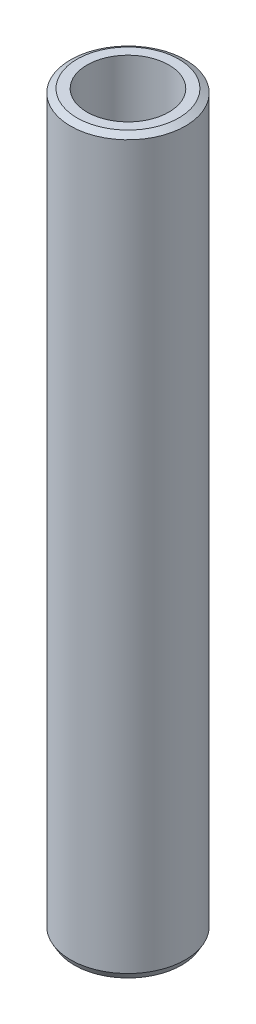
ISO-10303-21;
HEADER;
FILE_DESCRIPTION(('STEP AP214'),'2;1');
FILE_NAME('part.step','',(''),(''),'','','');
FILE_SCHEMA(('AUTOMOTIVE_DESIGN { 1 0 10303 214 1 1 1 1 }'));
ENDSEC;
DATA;
#1=APPLICATION_CONTEXT('core data for automotive mechanical design processes');
#2=APPLICATION_PROTOCOL_DEFINITION('international standard','automotive_design',2000,#1);
#3=PRODUCT_CONTEXT('',#1,'mechanical');
#4=PRODUCT('Part','Part','',(#3));
#5=PRODUCT_RELATED_PRODUCT_CATEGORY('part','',(#4));
#6=PRODUCT_DEFINITION_FORMATION('','',#4);
#7=PRODUCT_DEFINITION_CONTEXT('part definition',#1,'design');
#8=PRODUCT_DEFINITION('design','',#6,#7);
#9=PRODUCT_DEFINITION_SHAPE('','',#8);
#10=(LENGTH_UNIT() NAMED_UNIT(*) SI_UNIT(.MILLI.,.METRE.));
#11=(NAMED_UNIT(*) PLANE_ANGLE_UNIT() SI_UNIT($,.RADIAN.));
#12=(NAMED_UNIT(*) SI_UNIT($,.STERADIAN.) SOLID_ANGLE_UNIT());
#13=UNCERTAINTY_MEASURE_WITH_UNIT(LENGTH_MEASURE(1.E-05),#10,'distance_accuracy_value','');
#14=(GEOMETRIC_REPRESENTATION_CONTEXT(3) GLOBAL_UNCERTAINTY_ASSIGNED_CONTEXT((#13)) GLOBAL_UNIT_ASSIGNED_CONTEXT((#10,
#11,#12)) REPRESENTATION_CONTEXT('',''));
#15=CARTESIAN_POINT('',(0.,0.,0.));
#16=DIRECTION('',(0.,0.,1.));
#17=DIRECTION('',(1.,0.,0.));
#18=AXIS2_PLACEMENT_3D('',#15,#16,#17);
#19=CARTESIAN_POINT('',(0.,573.610338451361,0.));
#20=DIRECTION('',(0.,-1.,0.));
#21=DIRECTION('',(0.,0.,-1.));
#22=AXIS2_PLACEMENT_3D('',#19,#20,#21);
#23=CYLINDRICAL_SURFACE('',#22,45.);
#24=CARTESIAN_POINT('',(0.,570.648619737223,0.));
#25=DIRECTION('',(0.,1.,0.));
#26=DIRECTION('',(0.,0.,1.));
#27=AXIS2_PLACEMENT_3D('',#24,#25,#26);
#28=CIRCLE('',#27,45.);
#29=CARTESIAN_POINT('',(0.,570.648619737223,45.));
#30=VERTEX_POINT('',#29);
#31=EDGE_CURVE('E50',#30,#30,#28,.F.);
#32=ORIENTED_EDGE('',*,*,#31,.T.);
#33=EDGE_LOOP('',(#32));
#34=FACE_BOUND('',#33,.T.);
#35=CARTESIAN_POINT('',(0.,5.12984729061516,0.));
#36=DIRECTION('',(0.,1.,0.));
#37=DIRECTION('',(0.,0.,1.));
#38=AXIS2_PLACEMENT_3D('',#35,#36,#37);
#39=CIRCLE('',#38,45.);
#40=CARTESIAN_POINT('',(0.,5.12984729061516,45.));
#41=VERTEX_POINT('',#40);
#42=EDGE_CURVE('E51',#41,#41,#39,.T.);
#43=ORIENTED_EDGE('',*,*,#42,.T.);
#44=EDGE_LOOP('',(#43));
#45=FACE_BOUND('',#44,.T.);
#46=ADVANCED_FACE('F39',(#34,#45),#23,.T.);
#47=CARTESIAN_POINT('',(0.,573.610338451361,0.));
#48=DIRECTION('',(0.,1.,0.));
#49=DIRECTION('',(0.,0.,1.));
#50=AXIS2_PLACEMENT_3D('',#47,#48,#49);
#51=PLANE('',#50);
#52=CARTESIAN_POINT('',(0.,573.610338451361,0.));
#53=DIRECTION('',(0.,1.,0.));
#54=DIRECTION('',(0.,0.,1.));
#55=AXIS2_PLACEMENT_3D('',#52,#53,#54);
#56=CIRCLE('',#55,39.8701527093851);
#57=CARTESIAN_POINT('',(0.,573.610338451361,39.8701527093851));
#58=VERTEX_POINT('',#57);
#59=EDGE_CURVE('E54',#58,#58,#56,.T.);
#60=ORIENTED_EDGE('',*,*,#59,.T.);
#61=EDGE_LOOP('',(#60));
#62=FACE_BOUND('',#61,.T.);
#63=CARTESIAN_POINT('',(0.,573.610338451361,0.));
#64=DIRECTION('',(0.,1.,0.));
#65=DIRECTION('',(0.,0.,1.));
#66=AXIS2_PLACEMENT_3D('',#63,#64,#65);
#67=CIRCLE('',#66,32.0349497843565);
#68=CARTESIAN_POINT('',(0.,573.610338451361,32.0349497843565));
#69=VERTEX_POINT('',#68);
#70=EDGE_CURVE('E58',#69,#69,#67,.T.);
#71=ORIENTED_EDGE('',*,*,#70,.F.);
#72=EDGE_LOOP('',(#71));
#73=FACE_BOUND('',#72,.T.);
#74=ADVANCED_FACE('F69',(#62,#73),#51,.T.);
#75=CARTESIAN_POINT('',(0.,0.,0.));
#76=DIRECTION('',(0.,1.,0.));
#77=DIRECTION('',(0.,0.,1.));
#78=AXIS2_PLACEMENT_3D('',#75,#76,#77);
#79=PLANE('',#78);
#80=CARTESIAN_POINT('',(0.,0.,0.));
#81=DIRECTION('',(0.,1.,0.));
#82=DIRECTION('',(0.,0.,1.));
#83=AXIS2_PLACEMENT_3D('',#80,#81,#82);
#84=CIRCLE('',#83,42.0382812858616);
#85=CARTESIAN_POINT('',(0.,0.,42.0382812858616));
#86=VERTEX_POINT('',#85);
#87=EDGE_CURVE('E10',#86,#86,#84,.F.);
#88=ORIENTED_EDGE('',*,*,#87,.T.);
#89=EDGE_LOOP('',(#88));
#90=FACE_BOUND('',#89,.T.);
#91=CARTESIAN_POINT('',(0.,0.,0.));
#92=DIRECTION('',(0.,1.,0.));
#93=DIRECTION('',(0.,0.,1.));
#94=AXIS2_PLACEMENT_3D('',#91,#92,#93);
#95=CIRCLE('',#94,32.0349497843565);
#96=CARTESIAN_POINT('',(0.,0.,32.0349497843565));
#97=VERTEX_POINT('',#96);
#98=EDGE_CURVE('E63',#97,#97,#95,.T.);
#99=ORIENTED_EDGE('',*,*,#98,.T.);
#100=EDGE_LOOP('',(#99));
#101=FACE_BOUND('',#100,.T.);
#102=ADVANCED_FACE('F75',(#90,#101),#79,.F.);
#103=CARTESIAN_POINT('',(0.,573.610338451361,0.));
#104=DIRECTION('',(0.,-1.,0.));
#105=DIRECTION('',(0.,0.,-1.));
#106=AXIS2_PLACEMENT_3D('',#103,#104,#105);
#107=CYLINDRICAL_SURFACE('',#106,32.0349497843565);
#108=ORIENTED_EDGE('',*,*,#70,.T.);
#109=EDGE_LOOP('',(#108));
#110=FACE_BOUND('',#109,.T.);
#111=ORIENTED_EDGE('',*,*,#98,.F.);
#112=EDGE_LOOP('',(#111));
#113=FACE_BOUND('',#112,.T.);
#114=ADVANCED_FACE('F70',(#110,#113),#107,.F.);
#115=CARTESIAN_POINT('',(0.,573.610338451361,0.));
#116=DIRECTION('',(0.,-1.,0.));
#117=DIRECTION('',(0.,0.,-1.));
#118=AXIS2_PLACEMENT_3D('',#115,#116,#117);
#119=CONICAL_SURFACE('',#118,39.8701527093851,1.0471975511966);
#120=ORIENTED_EDGE('',*,*,#31,.F.);
#121=EDGE_LOOP('',(#120));
#122=FACE_BOUND('',#121,.T.);
#123=ORIENTED_EDGE('',*,*,#59,.F.);
#124=EDGE_LOOP('',(#123));
#125=FACE_BOUND('',#124,.T.);
#126=ADVANCED_FACE('F81',(#122,#125),#119,.T.);
#127=CARTESIAN_POINT('',(0.,5.12984729061516,0.));
#128=DIRECTION('',(0.,1.,0.));
#129=DIRECTION('',(0.,0.,1.));
#130=AXIS2_PLACEMENT_3D('',#127,#128,#129);
#131=CONICAL_SURFACE('',#130,45.,0.523598775598305);
#132=ORIENTED_EDGE('',*,*,#87,.F.);
#133=EDGE_LOOP('',(#132));
#134=FACE_BOUND('',#133,.T.);
#135=ORIENTED_EDGE('',*,*,#42,.F.);
#136=EDGE_LOOP('',(#135));
#137=FACE_BOUND('',#136,.T.);
#138=ADVANCED_FACE('F45',(#134,#137),#131,.T.);
#139=CLOSED_SHELL('',(#46,#74,#102,#114,#126,#138));
#140=MANIFOLD_SOLID_BREP('B2',#139);
#141=ADVANCED_BREP_SHAPE_REPRESENTATION('',(#18,#140),#14);
#142=SHAPE_DEFINITION_REPRESENTATION(#9,#141);
ENDSEC;
END-ISO-10303-21;
